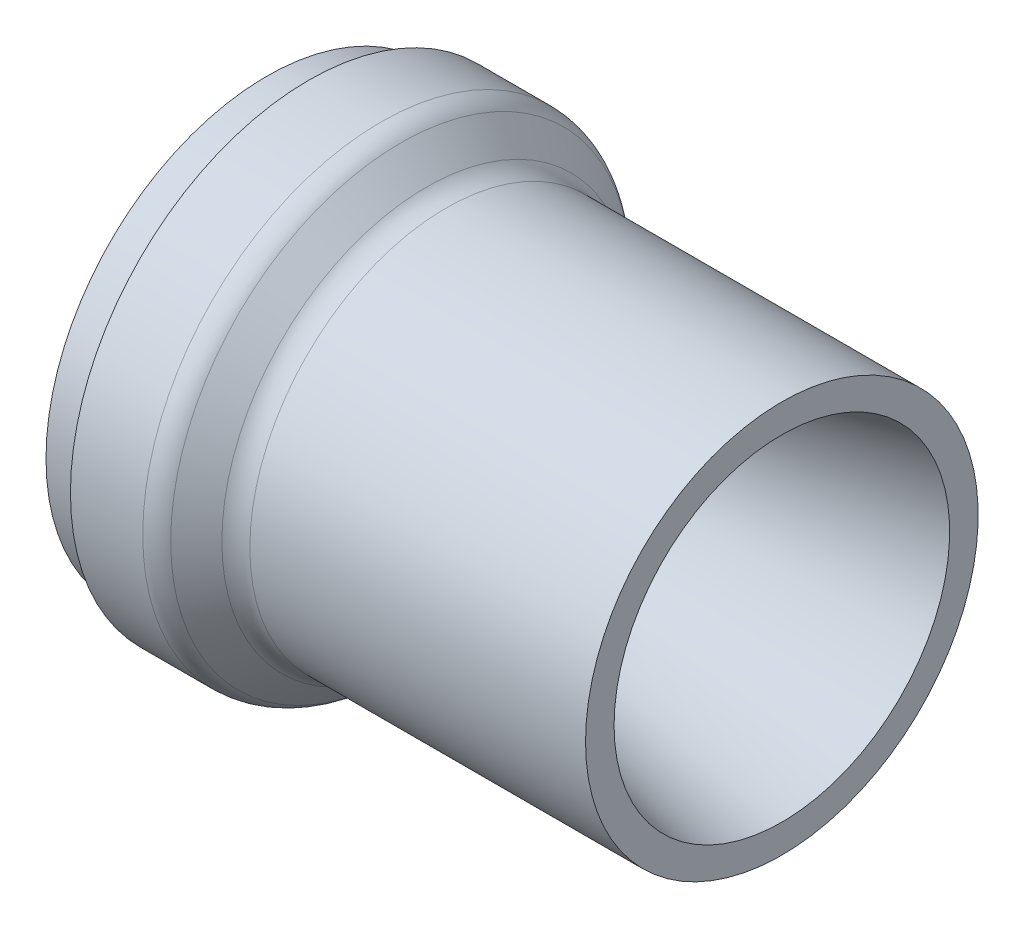
ISO-10303-21;
HEADER;
FILE_DESCRIPTION(('STEP AP214'),'2;1');
FILE_NAME('part.step','',(''),(''),'','','');
FILE_SCHEMA(('AUTOMOTIVE_DESIGN { 1 0 10303 214 1 1 1 1 }'));
ENDSEC;
DATA;
#1=APPLICATION_CONTEXT('core data for automotive mechanical design processes');
#2=APPLICATION_PROTOCOL_DEFINITION('international standard','automotive_design',2000,#1);
#3=PRODUCT_CONTEXT('',#1,'mechanical');
#4=PRODUCT('Part','Part','',(#3));
#5=PRODUCT_RELATED_PRODUCT_CATEGORY('part','',(#4));
#6=PRODUCT_DEFINITION_FORMATION('','',#4);
#7=PRODUCT_DEFINITION_CONTEXT('part definition',#1,'design');
#8=PRODUCT_DEFINITION('design','',#6,#7);
#9=PRODUCT_DEFINITION_SHAPE('','',#8);
#10=(LENGTH_UNIT() NAMED_UNIT(*) SI_UNIT(.MILLI.,.METRE.));
#11=(NAMED_UNIT(*) PLANE_ANGLE_UNIT() SI_UNIT($,.RADIAN.));
#12=(NAMED_UNIT(*) SI_UNIT($,.STERADIAN.) SOLID_ANGLE_UNIT());
#13=UNCERTAINTY_MEASURE_WITH_UNIT(LENGTH_MEASURE(1.E-05),#10,'distance_accuracy_value','');
#14=(GEOMETRIC_REPRESENTATION_CONTEXT(3) GLOBAL_UNCERTAINTY_ASSIGNED_CONTEXT((#13)) GLOBAL_UNIT_ASSIGNED_CONTEXT((#10,
#11,#12)) REPRESENTATION_CONTEXT('',''));
#15=CARTESIAN_POINT('',(0.,0.,0.));
#16=DIRECTION('',(0.,0.,1.));
#17=DIRECTION('',(1.,0.,0.));
#18=AXIS2_PLACEMENT_3D('',#15,#16,#17);
#19=CARTESIAN_POINT('',(30.4348719394654,50.546,0.));
#20=DIRECTION('',(-1.,0.,0.));
#21=DIRECTION('',(0.,0.,1.));
#22=AXIS2_PLACEMENT_3D('',#19,#20,#21);
#23=CONICAL_SURFACE('',#22,52.2421280605346,0.785398163397449);
#24=CARTESIAN_POINT('',(36.2401280605346,50.546,0.));
#25=DIRECTION('',(-1.,0.,0.));
#26=DIRECTION('',(0.,0.,1.));
#27=AXIS2_PLACEMENT_3D('',#24,#25,#26);
#28=CIRCLE('',#27,46.4368719394654);
#29=CARTESIAN_POINT('',(36.2401280605346,50.546,46.4368719394654));
#30=VERTEX_POINT('',#29);
#31=EDGE_CURVE('E12',#30,#30,#28,.T.);
#32=ORIENTED_EDGE('',*,*,#31,.T.);
#33=EDGE_LOOP('',(#32));
#34=FACE_BOUND('',#33,.T.);
#35=CARTESIAN_POINT('',(30.4348719394654,50.546,0.));
#36=DIRECTION('',(-1.,0.,0.));
#37=DIRECTION('',(0.,0.,1.));
#38=AXIS2_PLACEMENT_3D('',#35,#36,#37);
#39=CIRCLE('',#38,52.2421280605346);
#40=CARTESIAN_POINT('',(30.4348719394654,50.546,52.2421280605346));
#41=VERTEX_POINT('',#40);
#42=EDGE_CURVE('E103',#41,#41,#39,.T.);
#43=ORIENTED_EDGE('',*,*,#42,.F.);
#44=EDGE_LOOP('',(#43));
#45=FACE_BOUND('',#44,.T.);
#46=ADVANCED_FACE('F52',(#34,#45),#23,.T.);
#47=CARTESIAN_POINT('',(40.7302561210692,50.546,0.));
#48=DIRECTION('',(-1.,0.,0.));
#49=DIRECTION('',(0.,0.,1.));
#50=AXIS2_PLACEMENT_3D('',#47,#48,#49);
#51=TOROIDAL_SURFACE('',#50,50.9269999999999,6.35);
#52=CARTESIAN_POINT('',(40.7302561210692,50.546,0.));
#53=DIRECTION('',(-1.,0.,0.));
#54=DIRECTION('',(0.,0.,1.));
#55=AXIS2_PLACEMENT_3D('',#52,#53,#54);
#56=CIRCLE('',#55,44.5769999999999);
#57=CARTESIAN_POINT('',(40.7302561210692,50.546,44.5769999999999));
#58=VERTEX_POINT('',#57);
#59=EDGE_CURVE('E59',#58,#58,#56,.T.);
#60=ORIENTED_EDGE('',*,*,#59,.T.);
#61=EDGE_LOOP('',(#60));
#62=FACE_BOUND('',#61,.T.);
#63=ORIENTED_EDGE('',*,*,#31,.F.);
#64=EDGE_LOOP('',(#63));
#65=FACE_BOUND('',#64,.T.);
#66=ADVANCED_FACE('F112',(#62,#65),#51,.F.);
#67=CARTESIAN_POINT('',(0.,50.546,0.));
#68=DIRECTION('',(-1.,0.,0.));
#69=DIRECTION('',(0.,0.,1.));
#70=AXIS2_PLACEMENT_3D('',#67,#68,#69);
#71=CYLINDRICAL_SURFACE('',#70,44.5769999999999);
#72=CARTESIAN_POINT('',(116.957401037701,50.546,0.));
#73=DIRECTION('',(-1.,0.,0.));
#74=DIRECTION('',(0.,0.,1.));
#75=AXIS2_PLACEMENT_3D('',#72,#73,#74);
#76=CIRCLE('',#75,44.5769999999999);
#77=CARTESIAN_POINT('',(116.957401037701,50.546,44.5769999999999));
#78=VERTEX_POINT('',#77);
#79=EDGE_CURVE('E64',#78,#78,#76,.T.);
#80=ORIENTED_EDGE('',*,*,#79,.T.);
#81=EDGE_LOOP('',(#80));
#82=FACE_BOUND('',#81,.T.);
#83=ORIENTED_EDGE('',*,*,#59,.F.);
#84=EDGE_LOOP('',(#83));
#85=FACE_BOUND('',#84,.T.);
#86=ADVANCED_FACE('F116',(#82,#85),#71,.T.);
#87=CARTESIAN_POINT('',(116.957401037701,0.,0.));
#88=DIRECTION('',(1.,0.,0.));
#89=DIRECTION('',(0.,0.,-1.));
#90=AXIS2_PLACEMENT_3D('',#87,#88,#89);
#91=PLANE('',#90);
#92=CARTESIAN_POINT('',(116.957401037701,50.546,0.));
#93=DIRECTION('',(-1.,0.,0.));
#94=DIRECTION('',(0.,0.,1.));
#95=AXIS2_PLACEMENT_3D('',#92,#93,#94);
#96=CIRCLE('',#95,38.1);
#97=CARTESIAN_POINT('',(116.957401037701,50.546,38.1));
#98=VERTEX_POINT('',#97);
#99=EDGE_CURVE('E69',#98,#98,#96,.T.);
#100=ORIENTED_EDGE('',*,*,#99,.T.);
#101=EDGE_LOOP('',(#100));
#102=FACE_BOUND('',#101,.T.);
#103=ORIENTED_EDGE('',*,*,#79,.F.);
#104=EDGE_LOOP('',(#103));
#105=FACE_BOUND('',#104,.T.);
#106=ADVANCED_FACE('F120',(#102,#105),#91,.T.);
#107=CARTESIAN_POINT('',(116.957401037701,50.546,0.));
#108=DIRECTION('',(1.,0.,0.));
#109=DIRECTION('',(0.,0.,-1.));
#110=AXIS2_PLACEMENT_3D('',#107,#108,#109);
#111=CONICAL_SURFACE('',#110,38.1,0.209439510239313);
#112=CARTESIAN_POINT('',(21.3593172130957,50.546,0.));
#113=DIRECTION('',(-1.,0.,0.));
#114=DIRECTION('',(0.,0.,1.));
#115=AXIS2_PLACEMENT_3D('',#112,#113,#114);
#116=CIRCLE('',#115,17.78);
#117=CARTESIAN_POINT('',(21.3593172130957,50.546,17.78));
#118=VERTEX_POINT('',#117);
#119=EDGE_CURVE('E75',#118,#118,#116,.T.);
#120=ORIENTED_EDGE('',*,*,#119,.T.);
#121=EDGE_LOOP('',(#120));
#122=FACE_BOUND('',#121,.T.);
#123=ORIENTED_EDGE('',*,*,#99,.F.);
#124=EDGE_LOOP('',(#123));
#125=FACE_BOUND('',#124,.T.);
#126=ADVANCED_FACE('F127',(#122,#125),#111,.F.);
#127=CARTESIAN_POINT('',(0.,50.546,0.));
#128=DIRECTION('',(-1.,0.,0.));
#129=DIRECTION('',(0.,0.,1.));
#130=AXIS2_PLACEMENT_3D('',#127,#128,#129);
#131=CYLINDRICAL_SURFACE('',#130,17.78);
#132=ORIENTED_EDGE('',*,*,#119,.F.);
#133=EDGE_LOOP('',(#132));
#134=FACE_BOUND('',#133,.T.);
#135=CARTESIAN_POINT('',(15.0093172130957,50.546,0.));
#136=DIRECTION('',(-1.,0.,0.));
#137=DIRECTION('',(0.,0.,1.));
#138=AXIS2_PLACEMENT_3D('',#135,#136,#137);
#139=CIRCLE('',#138,17.78);
#140=CARTESIAN_POINT('',(15.0093172130957,50.546,17.78));
#141=VERTEX_POINT('',#140);
#142=EDGE_CURVE('E79',#141,#141,#139,.T.);
#143=ORIENTED_EDGE('',*,*,#142,.T.);
#144=EDGE_LOOP('',(#143));
#145=FACE_BOUND('',#144,.T.);
#146=ADVANCED_FACE('F131',(#134,#145),#131,.F.);
#147=CARTESIAN_POINT('',(0.,50.546,0.));
#148=DIRECTION('',(-1.,0.,0.));
#149=DIRECTION('',(0.,0.,1.));
#150=AXIS2_PLACEMENT_3D('',#147,#148,#149);
#151=CONICAL_SURFACE('',#150,43.7769,1.0471975511966);
#152=ORIENTED_EDGE('',*,*,#142,.F.);
#153=EDGE_LOOP('',(#152));
#154=FACE_BOUND('',#153,.T.);
#155=CARTESIAN_POINT('',(0.,50.546,0.));
#156=DIRECTION('',(-1.,0.,0.));
#157=DIRECTION('',(0.,0.,1.));
#158=AXIS2_PLACEMENT_3D('',#155,#156,#157);
#159=CIRCLE('',#158,43.7769);
#160=CARTESIAN_POINT('',(0.,50.546,43.7769));
#161=VERTEX_POINT('',#160);
#162=EDGE_CURVE('E83',#161,#161,#159,.T.);
#163=ORIENTED_EDGE('',*,*,#162,.T.);
#164=EDGE_LOOP('',(#163));
#165=FACE_BOUND('',#164,.T.);
#166=ADVANCED_FACE('F135',(#154,#165),#151,.F.);
#167=CARTESIAN_POINT('',(0.,0.,0.));
#168=DIRECTION('',(-1.,0.,0.));
#169=DIRECTION('',(0.,0.,1.));
#170=AXIS2_PLACEMENT_3D('',#167,#168,#169);
#171=PLANE('',#170);
#172=CARTESIAN_POINT('',(0.,50.546,0.));
#173=DIRECTION('',(-1.,0.,0.));
#174=DIRECTION('',(0.,0.,1.));
#175=AXIS2_PLACEMENT_3D('',#172,#173,#174);
#176=CIRCLE('',#175,50.1269);
#177=CARTESIAN_POINT('',(0.,50.546,50.1269));
#178=VERTEX_POINT('',#177);
#179=EDGE_CURVE('E87',#178,#178,#176,.T.);
#180=ORIENTED_EDGE('',*,*,#179,.T.);
#181=EDGE_LOOP('',(#180));
#182=FACE_BOUND('',#181,.T.);
#183=ORIENTED_EDGE('',*,*,#162,.F.);
#184=EDGE_LOOP('',(#183));
#185=FACE_BOUND('',#184,.T.);
#186=ADVANCED_FACE('F139',(#182,#185),#171,.T.);
#187=CARTESIAN_POINT('',(0.,50.546,0.));
#188=DIRECTION('',(-1.,0.,0.));
#189=DIRECTION('',(0.,0.,1.));
#190=AXIS2_PLACEMENT_3D('',#187,#188,#189);
#191=CYLINDRICAL_SURFACE('',#190,50.1269);
#192=CARTESIAN_POINT('',(9.525,50.546,0.));
#193=DIRECTION('',(-1.,0.,0.));
#194=DIRECTION('',(0.,0.,1.));
#195=AXIS2_PLACEMENT_3D('',#192,#193,#194);
#196=CIRCLE('',#195,50.1269);
#197=CARTESIAN_POINT('',(9.525,50.546,50.1269));
#198=VERTEX_POINT('',#197);
#199=EDGE_CURVE('E91',#198,#198,#196,.T.);
#200=ORIENTED_EDGE('',*,*,#199,.T.);
#201=EDGE_LOOP('',(#200));
#202=FACE_BOUND('',#201,.T.);
#203=ORIENTED_EDGE('',*,*,#179,.F.);
#204=EDGE_LOOP('',(#203));
#205=FACE_BOUND('',#204,.T.);
#206=ADVANCED_FACE('F143',(#202,#205),#191,.T.);
#207=CARTESIAN_POINT('',(9.525,0.,0.));
#208=DIRECTION('',(1.,0.,0.));
#209=DIRECTION('',(0.,0.,-1.));
#210=AXIS2_PLACEMENT_3D('',#207,#208,#209);
#211=PLANE('',#210);
#212=ORIENTED_EDGE('',*,*,#199,.F.);
#213=EDGE_LOOP('',(#212));
#214=FACE_BOUND('',#213,.T.);
#215=CARTESIAN_POINT('',(9.525,50.546,0.));
#216=DIRECTION('',(-1.,0.,0.));
#217=DIRECTION('',(0.,0.,1.));
#218=AXIS2_PLACEMENT_3D('',#215,#216,#217);
#219=CIRCLE('',#218,54.102);
#220=CARTESIAN_POINT('',(9.525,50.546,54.102));
#221=VERTEX_POINT('',#220);
#222=EDGE_CURVE('E95',#221,#221,#219,.T.);
#223=ORIENTED_EDGE('',*,*,#222,.T.);
#224=EDGE_LOOP('',(#223));
#225=FACE_BOUND('',#224,.T.);
#226=ADVANCED_FACE('F147',(#214,#225),#211,.F.);
#227=CARTESIAN_POINT('',(0.,50.546,0.));
#228=DIRECTION('',(-1.,0.,0.));
#229=DIRECTION('',(0.,0.,1.));
#230=AXIS2_PLACEMENT_3D('',#227,#228,#229);
#231=CYLINDRICAL_SURFACE('',#230,54.102);
#232=ORIENTED_EDGE('',*,*,#222,.F.);
#233=EDGE_LOOP('',(#232));
#234=FACE_BOUND('',#233,.T.);
#235=CARTESIAN_POINT('',(25.9447438789308,50.546,0.));
#236=DIRECTION('',(-1.,0.,0.));
#237=DIRECTION('',(0.,0.,1.));
#238=AXIS2_PLACEMENT_3D('',#235,#236,#237);
#239=CIRCLE('',#238,54.102);
#240=CARTESIAN_POINT('',(25.9447438789308,50.546,54.102));
#241=VERTEX_POINT('',#240);
#242=EDGE_CURVE('E99',#241,#241,#239,.T.);
#243=ORIENTED_EDGE('',*,*,#242,.T.);
#244=EDGE_LOOP('',(#243));
#245=FACE_BOUND('',#244,.T.);
#246=ADVANCED_FACE('F151',(#234,#245),#231,.T.);
#247=CARTESIAN_POINT('',(25.9447438789308,50.546,0.));
#248=DIRECTION('',(-1.,0.,0.));
#249=DIRECTION('',(0.,0.,1.));
#250=AXIS2_PLACEMENT_3D('',#247,#248,#249);
#251=TOROIDAL_SURFACE('',#250,47.752,6.35);
#252=ORIENTED_EDGE('',*,*,#42,.T.);
#253=EDGE_LOOP('',(#252));
#254=FACE_BOUND('',#253,.T.);
#255=ORIENTED_EDGE('',*,*,#242,.F.);
#256=EDGE_LOOP('',(#255));
#257=FACE_BOUND('',#256,.T.);
#258=ADVANCED_FACE('F108',(#254,#257),#251,.T.);
#259=CLOSED_SHELL('',(#46,#66,#86,#106,#126,#146,#166,#186,#206,#226,#246,#258));
#260=MANIFOLD_SOLID_BREP('B2',#259);
#261=ADVANCED_BREP_SHAPE_REPRESENTATION('',(#18,#260),#14);
#262=SHAPE_DEFINITION_REPRESENTATION(#9,#261);
ENDSEC;
END-ISO-10303-21;
